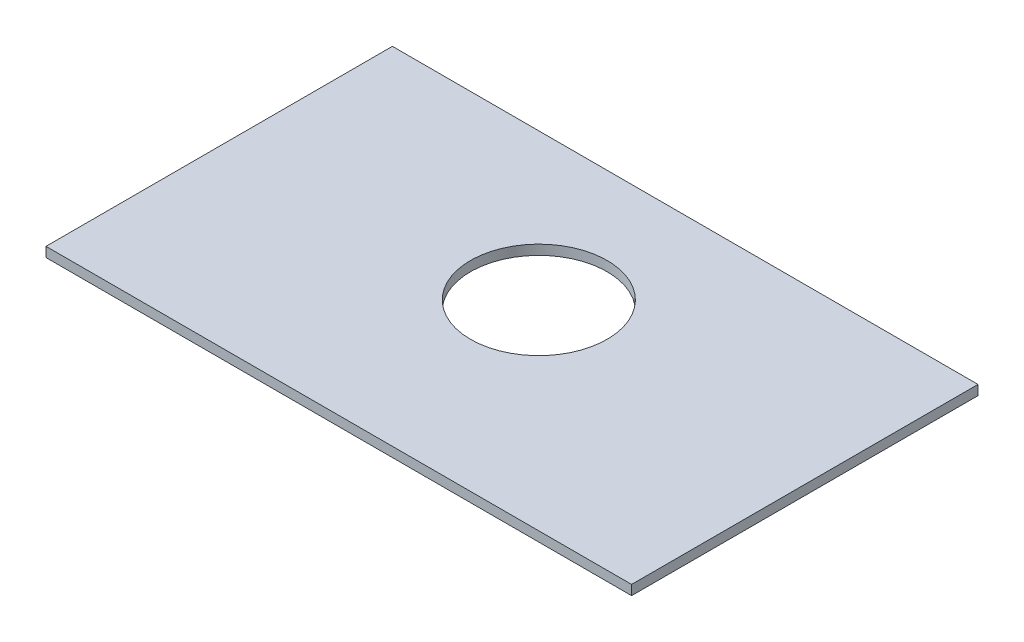
ISO-10303-21;
HEADER;
FILE_DESCRIPTION(('STEP AP214'),'2;1');
FILE_NAME('part.step','',(''),(''),'','','');
FILE_SCHEMA(('AUTOMOTIVE_DESIGN { 1 0 10303 214 1 1 1 1 }'));
ENDSEC;
DATA;
#1=APPLICATION_CONTEXT('core data for automotive mechanical design processes');
#2=APPLICATION_PROTOCOL_DEFINITION('international standard','automotive_design',2000,#1);
#3=PRODUCT_CONTEXT('',#1,'mechanical');
#4=PRODUCT('Part','Part','',(#3));
#5=PRODUCT_RELATED_PRODUCT_CATEGORY('part','',(#4));
#6=PRODUCT_DEFINITION_FORMATION('','',#4);
#7=PRODUCT_DEFINITION_CONTEXT('part definition',#1,'design');
#8=PRODUCT_DEFINITION('design','',#6,#7);
#9=PRODUCT_DEFINITION_SHAPE('','',#8);
#10=(LENGTH_UNIT() NAMED_UNIT(*) SI_UNIT(.MILLI.,.METRE.));
#11=(NAMED_UNIT(*) PLANE_ANGLE_UNIT() SI_UNIT($,.RADIAN.));
#12=(NAMED_UNIT(*) SI_UNIT($,.STERADIAN.) SOLID_ANGLE_UNIT());
#13=UNCERTAINTY_MEASURE_WITH_UNIT(LENGTH_MEASURE(1.E-05),#10,'distance_accuracy_value','');
#14=(GEOMETRIC_REPRESENTATION_CONTEXT(3) GLOBAL_UNCERTAINTY_ASSIGNED_CONTEXT((#13)) GLOBAL_UNIT_ASSIGNED_CONTEXT((#10,
#11,#12)) REPRESENTATION_CONTEXT('',''));
#15=CARTESIAN_POINT('',(0.,0.,0.));
#16=DIRECTION('',(0.,0.,1.));
#17=DIRECTION('',(1.,0.,0.));
#18=AXIS2_PLACEMENT_3D('',#15,#16,#17);
#19=CARTESIAN_POINT('',(0.,3.,0.));
#20=DIRECTION('',(0.,1.,0.));
#21=DIRECTION('',(0.,0.,1.));
#22=AXIS2_PLACEMENT_3D('',#19,#20,#21);
#23=PLANE('',#22);
#24=DIRECTION('',(0.,0.,1.));
#25=VECTOR('',#24,1.);
#26=CARTESIAN_POINT('',(-50.2879481708871,3.,-99.5280133324612));
#27=LINE('',#26,#25);
#28=CARTESIAN_POINT('',(-50.2879481708871,3.,-99.5280133324612));
#29=VERTEX_POINT('',#28);
#30=CARTESIAN_POINT('',(-50.2879481708871,3.,6.95198666753881));
#31=VERTEX_POINT('',#30);
#32=EDGE_CURVE('E85',#29,#31,#27,.T.);
#33=ORIENTED_EDGE('',*,*,#32,.T.);
#34=DIRECTION('',(1.,0.,0.));
#35=VECTOR('',#34,1.);
#36=CARTESIAN_POINT('',(-50.2879481708871,3.,6.95198666753881));
#37=LINE('',#36,#35);
#38=CARTESIAN_POINT('',(129.712051829113,3.,6.95198666753881));
#39=VERTEX_POINT('',#38);
#40=EDGE_CURVE('E80',#31,#39,#37,.T.);
#41=ORIENTED_EDGE('',*,*,#40,.T.);
#42=DIRECTION('',(0.,0.,-1.));
#43=VECTOR('',#42,1.);
#44=CARTESIAN_POINT('',(129.712051829113,3.,-99.5280133324612));
#45=LINE('',#44,#43);
#46=CARTESIAN_POINT('',(129.712051829113,3.,-99.5280133324612));
#47=VERTEX_POINT('',#46);
#48=EDGE_CURVE('E83',#39,#47,#45,.T.);
#49=ORIENTED_EDGE('',*,*,#48,.T.);
#50=DIRECTION('',(-1.,0.,0.));
#51=VECTOR('',#50,1.);
#52=CARTESIAN_POINT('',(-50.2879481708871,3.,-99.5280133324612));
#53=LINE('',#52,#51);
#54=EDGE_CURVE('E50',#47,#29,#53,.T.);
#55=ORIENTED_EDGE('',*,*,#54,.T.);
#56=EDGE_LOOP('',(#33,#41,#49,#55));
#57=FACE_BOUND('',#56,.T.);
#58=CARTESIAN_POINT('',(39.7120518291128,3.,-54.5280133324612));
#59=DIRECTION('',(0.,1.,0.));
#60=DIRECTION('',(0.,0.,1.));
#61=AXIS2_PLACEMENT_3D('',#58,#59,#60);
#62=CIRCLE('',#61,21.);
#63=CARTESIAN_POINT('',(39.7120518291128,3.,-33.5280133324612));
#64=VERTEX_POINT('',#63);
#65=EDGE_CURVE('E100',#64,#64,#62,.T.);
#66=ORIENTED_EDGE('',*,*,#65,.F.);
#67=EDGE_LOOP('',(#66));
#68=FACE_BOUND('',#67,.T.);
#69=ADVANCED_FACE('F33',(#57,#68),#23,.T.);
#70=CARTESIAN_POINT('',(0.,0.,0.));
#71=DIRECTION('',(0.,1.,0.));
#72=DIRECTION('',(0.,0.,1.));
#73=AXIS2_PLACEMENT_3D('',#70,#71,#72);
#74=PLANE('',#73);
#75=DIRECTION('',(0.,0.,1.));
#76=VECTOR('',#75,1.);
#77=CARTESIAN_POINT('',(-50.2879481708871,0.,-99.5280133324612));
#78=LINE('',#77,#76);
#79=CARTESIAN_POINT('',(-50.2879481708871,0.,-99.5280133324612));
#80=VERTEX_POINT('',#79);
#81=CARTESIAN_POINT('',(-50.2879481708871,0.,6.95198666753881));
#82=VERTEX_POINT('',#81);
#83=EDGE_CURVE('E97',#80,#82,#78,.T.);
#84=ORIENTED_EDGE('',*,*,#83,.F.);
#85=DIRECTION('',(-1.,0.,0.));
#86=VECTOR('',#85,1.);
#87=CARTESIAN_POINT('',(-50.2879481708871,0.,-99.5280133324612));
#88=LINE('',#87,#86);
#89=CARTESIAN_POINT('',(129.712051829113,0.,-99.5280133324612));
#90=VERTEX_POINT('',#89);
#91=EDGE_CURVE('E73',#90,#80,#88,.T.);
#92=ORIENTED_EDGE('',*,*,#91,.F.);
#93=DIRECTION('',(0.,0.,-1.));
#94=VECTOR('',#93,1.);
#95=CARTESIAN_POINT('',(129.712051829113,0.,-99.5280133324612));
#96=LINE('',#95,#94);
#97=CARTESIAN_POINT('',(129.712051829113,0.,6.95198666753881));
#98=VERTEX_POINT('',#97);
#99=EDGE_CURVE('E67',#98,#90,#96,.T.);
#100=ORIENTED_EDGE('',*,*,#99,.F.);
#101=DIRECTION('',(1.,0.,0.));
#102=VECTOR('',#101,1.);
#103=CARTESIAN_POINT('',(-50.2879481708871,0.,6.95198666753881));
#104=LINE('',#103,#102);
#105=EDGE_CURVE('E89',#82,#98,#104,.T.);
#106=ORIENTED_EDGE('',*,*,#105,.F.);
#107=EDGE_LOOP('',(#84,#92,#100,#106));
#108=FACE_BOUND('',#107,.T.);
#109=CARTESIAN_POINT('',(39.7120518291128,0.,-54.5280133324612));
#110=DIRECTION('',(0.,1.,0.));
#111=DIRECTION('',(0.,0.,1.));
#112=AXIS2_PLACEMENT_3D('',#109,#110,#111);
#113=CIRCLE('',#112,21.);
#114=CARTESIAN_POINT('',(39.7120518291128,0.,-33.5280133324612));
#115=VERTEX_POINT('',#114);
#116=EDGE_CURVE('E112',#115,#115,#113,.T.);
#117=ORIENTED_EDGE('',*,*,#116,.T.);
#118=EDGE_LOOP('',(#117));
#119=FACE_BOUND('',#118,.T.);
#120=ADVANCED_FACE('F108',(#108,#119),#74,.F.);
#121=CARTESIAN_POINT('',(-50.2879481708871,3.,-99.5280133324612));
#122=DIRECTION('',(1.,0.,0.));
#123=DIRECTION('',(0.,0.,-1.));
#124=AXIS2_PLACEMENT_3D('',#121,#122,#123);
#125=PLANE('',#124);
#126=ORIENTED_EDGE('',*,*,#83,.T.);
#127=DIRECTION('',(0.,-1.,0.));
#128=VECTOR('',#127,1.);
#129=CARTESIAN_POINT('',(-50.2879481708871,3.,6.95198666753881));
#130=LINE('',#129,#128);
#131=EDGE_CURVE('E11',#31,#82,#130,.T.);
#132=ORIENTED_EDGE('',*,*,#131,.F.);
#133=ORIENTED_EDGE('',*,*,#32,.F.);
#134=DIRECTION('',(0.,-1.,0.));
#135=VECTOR('',#134,1.);
#136=CARTESIAN_POINT('',(-50.2879481708871,3.,-99.5280133324612));
#137=LINE('',#136,#135);
#138=EDGE_CURVE('E93',#29,#80,#137,.T.);
#139=ORIENTED_EDGE('',*,*,#138,.T.);
#140=EDGE_LOOP('',(#126,#132,#133,#139));
#141=FACE_BOUND('',#140,.T.);
#142=ADVANCED_FACE('F35',(#141),#125,.F.);
#143=CARTESIAN_POINT('',(-50.2879481708871,3.,6.95198666753881));
#144=DIRECTION('',(0.,0.,-1.));
#145=DIRECTION('',(-1.,0.,0.));
#146=AXIS2_PLACEMENT_3D('',#143,#144,#145);
#147=PLANE('',#146);
#148=ORIENTED_EDGE('',*,*,#105,.T.);
#149=DIRECTION('',(0.,-1.,0.));
#150=VECTOR('',#149,1.);
#151=CARTESIAN_POINT('',(129.712051829113,3.,6.95198666753881));
#152=LINE('',#151,#150);
#153=EDGE_CURVE('E42',#39,#98,#152,.T.);
#154=ORIENTED_EDGE('',*,*,#153,.F.);
#155=ORIENTED_EDGE('',*,*,#40,.F.);
#156=ORIENTED_EDGE('',*,*,#131,.T.);
#157=EDGE_LOOP('',(#148,#154,#155,#156));
#158=FACE_BOUND('',#157,.T.);
#159=ADVANCED_FACE('F88',(#158),#147,.F.);
#160=CARTESIAN_POINT('',(129.712051829113,3.,-99.5280133324612));
#161=DIRECTION('',(-1.,0.,0.));
#162=DIRECTION('',(0.,0.,1.));
#163=AXIS2_PLACEMENT_3D('',#160,#161,#162);
#164=PLANE('',#163);
#165=ORIENTED_EDGE('',*,*,#99,.T.);
#166=DIRECTION('',(0.,-1.,0.));
#167=VECTOR('',#166,1.);
#168=CARTESIAN_POINT('',(129.712051829113,3.,-99.5280133324612));
#169=LINE('',#168,#167);
#170=EDGE_CURVE('E90',#47,#90,#169,.T.);
#171=ORIENTED_EDGE('',*,*,#170,.F.);
#172=ORIENTED_EDGE('',*,*,#48,.F.);
#173=ORIENTED_EDGE('',*,*,#153,.T.);
#174=EDGE_LOOP('',(#165,#171,#172,#173));
#175=FACE_BOUND('',#174,.T.);
#176=ADVANCED_FACE('F91',(#175),#164,.F.);
#177=CARTESIAN_POINT('',(-50.2879481708871,3.,-99.5280133324612));
#178=DIRECTION('',(0.,0.,1.));
#179=DIRECTION('',(1.,0.,0.));
#180=AXIS2_PLACEMENT_3D('',#177,#178,#179);
#181=PLANE('',#180);
#182=ORIENTED_EDGE('',*,*,#91,.T.);
#183=ORIENTED_EDGE('',*,*,#138,.F.);
#184=ORIENTED_EDGE('',*,*,#54,.F.);
#185=ORIENTED_EDGE('',*,*,#170,.T.);
#186=EDGE_LOOP('',(#182,#183,#184,#185));
#187=FACE_BOUND('',#186,.T.);
#188=ADVANCED_FACE('F105',(#187),#181,.F.);
#189=CARTESIAN_POINT('',(39.7120518291128,3.,-54.5280133324612));
#190=DIRECTION('',(0.,-1.,0.));
#191=DIRECTION('',(0.,0.,-1.));
#192=AXIS2_PLACEMENT_3D('',#189,#190,#191);
#193=CYLINDRICAL_SURFACE('',#192,21.);
#194=ORIENTED_EDGE('',*,*,#65,.T.);
#195=EDGE_LOOP('',(#194));
#196=FACE_BOUND('',#195,.T.);
#197=ORIENTED_EDGE('',*,*,#116,.F.);
#198=EDGE_LOOP('',(#197));
#199=FACE_BOUND('',#198,.T.);
#200=ADVANCED_FACE('F118',(#196,#199),#193,.F.);
#201=CLOSED_SHELL('',(#69,#120,#142,#159,#176,#188,#200));
#202=MANIFOLD_SOLID_BREP('B2',#201);
#203=ADVANCED_BREP_SHAPE_REPRESENTATION('',(#18,#202),#14);
#204=SHAPE_DEFINITION_REPRESENTATION(#9,#203);
ENDSEC;
END-ISO-10303-21;
